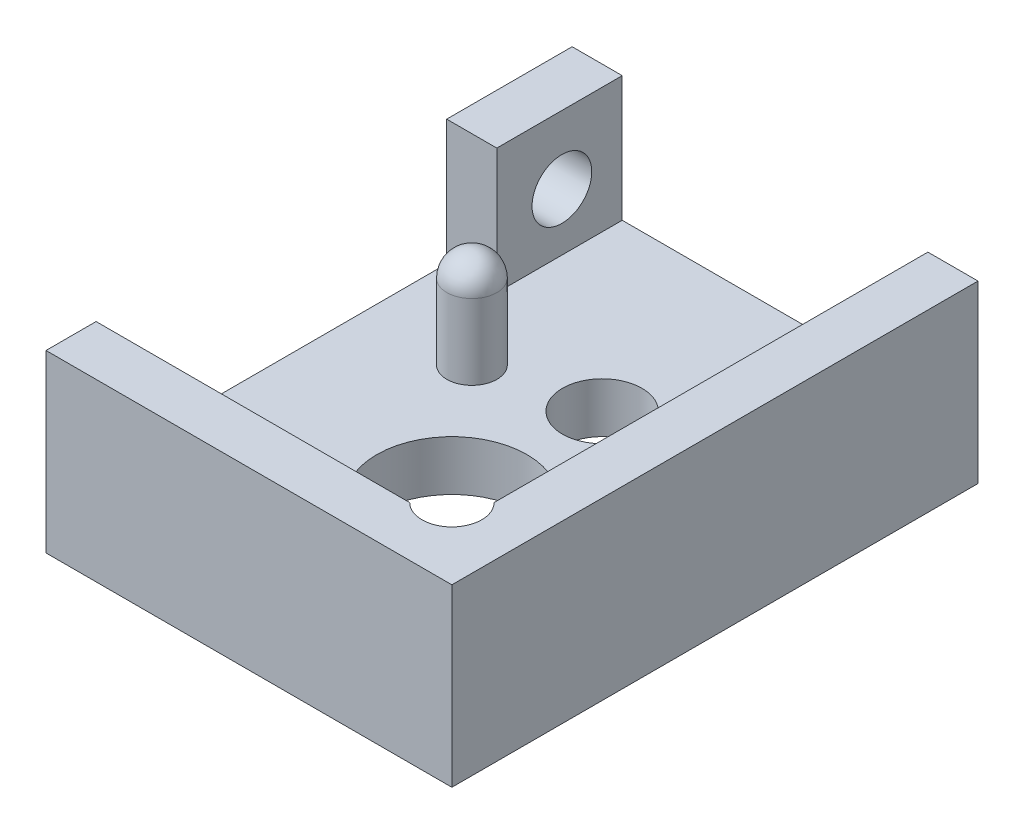
ISO-10303-21;
HEADER;
FILE_DESCRIPTION(('STEP AP214'),'2;1');
FILE_NAME('part.step','',(''),(''),'','','');
FILE_SCHEMA(('AUTOMOTIVE_DESIGN { 1 0 10303 214 1 1 1 1 }'));
ENDSEC;
DATA;
#1=APPLICATION_CONTEXT('core data for automotive mechanical design processes');
#2=APPLICATION_PROTOCOL_DEFINITION('international standard','automotive_design',2000,#1);
#3=PRODUCT_CONTEXT('',#1,'mechanical');
#4=PRODUCT('Part','Part','',(#3));
#5=PRODUCT_RELATED_PRODUCT_CATEGORY('part','',(#4));
#6=PRODUCT_DEFINITION_FORMATION('','',#4);
#7=PRODUCT_DEFINITION_CONTEXT('part definition',#1,'design');
#8=PRODUCT_DEFINITION('design','',#6,#7);
#9=PRODUCT_DEFINITION_SHAPE('','',#8);
#10=(LENGTH_UNIT() NAMED_UNIT(*) SI_UNIT(.MILLI.,.METRE.));
#11=(NAMED_UNIT(*) PLANE_ANGLE_UNIT() SI_UNIT($,.RADIAN.));
#12=(NAMED_UNIT(*) SI_UNIT($,.STERADIAN.) SOLID_ANGLE_UNIT());
#13=UNCERTAINTY_MEASURE_WITH_UNIT(LENGTH_MEASURE(1.E-05),#10,'distance_accuracy_value','');
#14=(GEOMETRIC_REPRESENTATION_CONTEXT(3) GLOBAL_UNCERTAINTY_ASSIGNED_CONTEXT((#13)) GLOBAL_UNIT_ASSIGNED_CONTEXT((#10,
#11,#12)) REPRESENTATION_CONTEXT('',''));
#15=CARTESIAN_POINT('',(0.,0.,0.));
#16=DIRECTION('',(0.,0.,1.));
#17=DIRECTION('',(1.,0.,0.));
#18=AXIS2_PLACEMENT_3D('',#15,#16,#17);
#19=CARTESIAN_POINT('',(-4.05,3.5,-5.75));
#20=DIRECTION('',(1.,0.,0.));
#21=DIRECTION('',(0.,0.,-1.));
#22=AXIS2_PLACEMENT_3D('',#19,#20,#21);
#23=PLANE('',#22);
#24=CARTESIAN_POINT('',(-4.05,2.14366257524023,-3.54575426754611));
#25=DIRECTION('',(-1.,0.,0.));
#26=DIRECTION('',(0.,0.,1.));
#27=AXIS2_PLACEMENT_3D('',#24,#25,#26);
#28=CIRCLE('',#27,0.595629999999989);
#29=CARTESIAN_POINT('',(-4.05,2.14366257524023,-2.95012426754612));
#30=VERTEX_POINT('',#29);
#31=EDGE_CURVE('E262',#30,#30,#28,.T.);
#32=ORIENTED_EDGE('',*,*,#31,.F.);
#33=EDGE_LOOP('',(#32));
#34=FACE_BOUND('',#33,.T.);
#35=DIRECTION('',(0.,-1.,0.));
#36=VECTOR('',#35,1.);
#37=CARTESIAN_POINT('',(-4.05,4.,-2.24649786886744));
#38=LINE('',#37,#36);
#39=CARTESIAN_POINT('',(-4.05,3.5,-2.24649786886744));
#40=VERTEX_POINT('',#39);
#41=CARTESIAN_POINT('',(-4.05,1.,-2.24649786886744));
#42=VERTEX_POINT('',#41);
#43=EDGE_CURVE('E124',#40,#42,#38,.T.);
#44=ORIENTED_EDGE('',*,*,#43,.F.);
#45=DIRECTION('',(0.,0.,1.));
#46=VECTOR('',#45,1.);
#47=CARTESIAN_POINT('',(-4.05,3.5,-5.75));
#48=LINE('',#47,#46);
#49=CARTESIAN_POINT('',(-4.05,3.5,-4.75));
#50=VERTEX_POINT('',#49);
#51=EDGE_CURVE('E161',#50,#40,#48,.T.);
#52=ORIENTED_EDGE('',*,*,#51,.F.);
#53=DIRECTION('',(0.,-1.,0.));
#54=VECTOR('',#53,1.);
#55=CARTESIAN_POINT('',(-4.05,3.5,-4.75));
#56=LINE('',#55,#54);
#57=CARTESIAN_POINT('',(-4.05,0.,-4.75));
#58=VERTEX_POINT('',#57);
#59=EDGE_CURVE('E249',#50,#58,#56,.T.);
#60=ORIENTED_EDGE('',*,*,#59,.T.);
#61=DIRECTION('',(0.,0.,1.));
#62=VECTOR('',#61,1.);
#63=CARTESIAN_POINT('',(-4.05,0.,-5.75));
#64=LINE('',#63,#62);
#65=CARTESIAN_POINT('',(-4.05,0.,5.75));
#66=VERTEX_POINT('',#65);
#67=EDGE_CURVE('E146',#58,#66,#64,.T.);
#68=ORIENTED_EDGE('',*,*,#67,.T.);
#69=DIRECTION('',(0.,-1.,0.));
#70=VECTOR('',#69,1.);
#71=CARTESIAN_POINT('',(-4.05,3.5,5.75));
#72=LINE('',#71,#70);
#73=CARTESIAN_POINT('',(-4.05,3.5,5.75));
#74=VERTEX_POINT('',#73);
#75=EDGE_CURVE('E177',#74,#66,#72,.T.);
#76=ORIENTED_EDGE('',*,*,#75,.F.);
#77=CARTESIAN_POINT('',(-4.05,3.5,4.75));
#78=VERTEX_POINT('',#77);
#79=EDGE_CURVE('E165',#78,#74,#48,.T.);
#80=ORIENTED_EDGE('',*,*,#79,.F.);
#81=DIRECTION('',(0.,-1.,0.));
#82=VECTOR('',#81,1.);
#83=CARTESIAN_POINT('',(-4.05,4.,4.75));
#84=LINE('',#83,#82);
#85=CARTESIAN_POINT('',(-4.05,1.,4.75));
#86=VERTEX_POINT('',#85);
#87=EDGE_CURVE('E223',#78,#86,#84,.T.);
#88=ORIENTED_EDGE('',*,*,#87,.T.);
#89=DIRECTION('',(0.,0.,1.));
#90=VECTOR('',#89,1.);
#91=CARTESIAN_POINT('',(-4.05,1.,4.75));
#92=LINE('',#91,#90);
#93=EDGE_CURVE('E129',#42,#86,#92,.T.);
#94=ORIENTED_EDGE('',*,*,#93,.F.);
#95=EDGE_LOOP('',(#44,#52,#60,#68,#76,#80,#88,#94));
#96=FACE_BOUND('',#95,.T.);
#97=ADVANCED_FACE('F35',(#34,#96),#23,.F.);
#98=CARTESIAN_POINT('',(0.,3.5,0.));
#99=DIRECTION('',(0.,-1.,0.));
#100=DIRECTION('',(0.,0.,-1.));
#101=AXIS2_PLACEMENT_3D('',#98,#99,#100);
#102=PLANE('',#101);
#103=DIRECTION('',(-1.,0.,0.));
#104=VECTOR('',#103,1.);
#105=CARTESIAN_POINT('',(0.,3.5,-2.24649786886744));
#106=LINE('',#105,#104);
#107=CARTESIAN_POINT('',(-3.05,3.5,-2.24649786886744));
#108=VERTEX_POINT('',#107);
#109=EDGE_CURVE('E255',#108,#40,#106,.T.);
#110=ORIENTED_EDGE('',*,*,#109,.F.);
#111=DIRECTION('',(0.,0.,1.));
#112=VECTOR('',#111,1.);
#113=CARTESIAN_POINT('',(-3.05,3.5,-4.75));
#114=LINE('',#113,#112);
#115=CARTESIAN_POINT('',(-3.05,3.5,-4.75));
#116=VERTEX_POINT('',#115);
#117=EDGE_CURVE('E139',#116,#108,#114,.T.);
#118=ORIENTED_EDGE('',*,*,#117,.F.);
#119=DIRECTION('',(-1.,0.,0.));
#120=VECTOR('',#119,1.);
#121=CARTESIAN_POINT('',(0.,3.5,-4.75));
#122=LINE('',#121,#120);
#123=EDGE_CURVE('E58',#116,#50,#122,.T.);
#124=ORIENTED_EDGE('',*,*,#123,.T.);
#125=ORIENTED_EDGE('',*,*,#51,.T.);
#126=EDGE_LOOP('',(#110,#118,#124,#125));
#127=FACE_BOUND('',#126,.T.);
#128=ADVANCED_FACE('F270',(#127),#102,.F.);
#129=DIRECTION('',(1.,0.,0.));
#130=VECTOR('',#129,1.);
#131=CARTESIAN_POINT('',(3.05,3.5,4.75));
#132=LINE('',#131,#130);
#133=CARTESIAN_POINT('',(2.20810098864976,3.5,4.75));
#134=VERTEX_POINT('',#133);
#135=EDGE_CURVE('E218',#78,#134,#132,.T.);
#136=ORIENTED_EDGE('',*,*,#135,.F.);
#137=ORIENTED_EDGE('',*,*,#79,.T.);
#138=DIRECTION('',(1.,0.,0.));
#139=VECTOR('',#138,1.);
#140=CARTESIAN_POINT('',(4.05,3.5,5.75));
#141=LINE('',#140,#139);
#142=CARTESIAN_POINT('',(4.05,3.5,5.75));
#143=VERTEX_POINT('',#142);
#144=EDGE_CURVE('E164',#74,#143,#141,.T.);
#145=ORIENTED_EDGE('',*,*,#144,.T.);
#146=DIRECTION('',(0.,0.,-1.));
#147=VECTOR('',#146,1.);
#148=CARTESIAN_POINT('',(4.05,3.5,-5.75));
#149=LINE('',#148,#147);
#150=CARTESIAN_POINT('',(4.05,3.5,-4.75));
#151=VERTEX_POINT('',#150);
#152=EDGE_CURVE('E167',#143,#151,#149,.T.);
#153=ORIENTED_EDGE('',*,*,#152,.T.);
#154=CARTESIAN_POINT('',(3.05,3.5,-4.75));
#155=VERTEX_POINT('',#154);
#156=EDGE_CURVE('E248',#151,#155,#122,.T.);
#157=ORIENTED_EDGE('',*,*,#156,.T.);
#158=DIRECTION('',(0.,0.,-1.));
#159=VECTOR('',#158,1.);
#160=CARTESIAN_POINT('',(3.05,3.5,-4.75));
#161=LINE('',#160,#159);
#162=CARTESIAN_POINT('',(3.05,3.5,3.90810098864976));
#163=VERTEX_POINT('',#162);
#164=EDGE_CURVE('E215',#163,#155,#161,.T.);
#165=ORIENTED_EDGE('',*,*,#164,.F.);
#166=CARTESIAN_POINT('',(2.62905049432488,3.5,4.32905049432488));
#167=DIRECTION('',(0.,1.,0.));
#168=DIRECTION('',(0.,0.,1.));
#169=AXIS2_PLACEMENT_3D('',#166,#167,#168);
#170=CIRCLE('',#169,0.595312500000001);
#171=EDGE_CURVE('E50',#134,#163,#170,.T.);
#172=ORIENTED_EDGE('',*,*,#171,.F.);
#173=EDGE_LOOP('',(#136,#137,#145,#153,#157,#165,#172));
#174=FACE_BOUND('',#173,.T.);
#175=ADVANCED_FACE('F226',(#174),#102,.F.);
#176=CARTESIAN_POINT('',(-3.05,-11.2898184219234,-4.75));
#177=DIRECTION('',(-1.,0.,0.));
#178=DIRECTION('',(0.,0.,1.));
#179=AXIS2_PLACEMENT_3D('',#176,#177,#178);
#180=PLANE('',#179);
#181=CARTESIAN_POINT('',(-3.05,2.14366257524023,-3.54575426754611));
#182=DIRECTION('',(-1.,0.,0.));
#183=DIRECTION('',(0.,0.,1.));
#184=AXIS2_PLACEMENT_3D('',#181,#182,#183);
#185=CIRCLE('',#184,0.595629999999989);
#186=CARTESIAN_POINT('',(-3.05,2.14366257524023,-2.95012426754612));
#187=VERTEX_POINT('',#186);
#188=EDGE_CURVE('E130',#187,#187,#185,.T.);
#189=ORIENTED_EDGE('',*,*,#188,.T.);
#190=EDGE_LOOP('',(#189));
#191=FACE_BOUND('',#190,.T.);
#192=DIRECTION('',(0.,1.,0.));
#193=VECTOR('',#192,1.);
#194=CARTESIAN_POINT('',(-3.05,-11.2898184219234,-2.24649786886744));
#195=LINE('',#194,#193);
#196=CARTESIAN_POINT('',(-3.05,1.,-2.24649786886744));
#197=VERTEX_POINT('',#196);
#198=EDGE_CURVE('E121',#197,#108,#195,.T.);
#199=ORIENTED_EDGE('',*,*,#198,.F.);
#200=DIRECTION('',(0.,0.,1.));
#201=VECTOR('',#200,1.);
#202=CARTESIAN_POINT('',(-3.05,1.,-4.75));
#203=LINE('',#202,#201);
#204=CARTESIAN_POINT('',(-3.05,1.,-4.75));
#205=VERTEX_POINT('',#204);
#206=EDGE_CURVE('E136',#205,#197,#203,.T.);
#207=ORIENTED_EDGE('',*,*,#206,.F.);
#208=DIRECTION('',(0.,1.,0.));
#209=VECTOR('',#208,1.);
#210=CARTESIAN_POINT('',(-3.05,-11.2898184219234,-4.75));
#211=LINE('',#210,#209);
#212=EDGE_CURVE('E147',#205,#116,#211,.T.);
#213=ORIENTED_EDGE('',*,*,#212,.T.);
#214=ORIENTED_EDGE('',*,*,#117,.T.);
#215=EDGE_LOOP('',(#199,#207,#213,#214));
#216=FACE_BOUND('',#215,.T.);
#217=ADVANCED_FACE('F135',(#191,#216),#180,.F.);
#218=CARTESIAN_POINT('',(4.05,3.5,5.75));
#219=DIRECTION('',(0.,0.,-1.));
#220=DIRECTION('',(-1.,0.,0.));
#221=AXIS2_PLACEMENT_3D('',#218,#219,#220);
#222=PLANE('',#221);
#223=DIRECTION('',(1.,0.,0.));
#224=VECTOR('',#223,1.);
#225=CARTESIAN_POINT('',(4.05,0.,5.75));
#226=LINE('',#225,#224);
#227=CARTESIAN_POINT('',(4.05,0.,5.75));
#228=VERTEX_POINT('',#227);
#229=EDGE_CURVE('E149',#66,#228,#226,.T.);
#230=ORIENTED_EDGE('',*,*,#229,.T.);
#231=DIRECTION('',(0.,-1.,0.));
#232=VECTOR('',#231,1.);
#233=CARTESIAN_POINT('',(4.05,3.5,5.75));
#234=LINE('',#233,#232);
#235=EDGE_CURVE('E169',#143,#228,#234,.T.);
#236=ORIENTED_EDGE('',*,*,#235,.F.);
#237=ORIENTED_EDGE('',*,*,#144,.F.);
#238=ORIENTED_EDGE('',*,*,#75,.T.);
#239=EDGE_LOOP('',(#230,#236,#237,#238));
#240=FACE_BOUND('',#239,.T.);
#241=ADVANCED_FACE('F286',(#240),#222,.F.);
#242=CARTESIAN_POINT('',(4.05,3.5,-5.75));
#243=DIRECTION('',(-1.,0.,0.));
#244=DIRECTION('',(0.,0.,1.));
#245=AXIS2_PLACEMENT_3D('',#242,#243,#244);
#246=PLANE('',#245);
#247=DIRECTION('',(0.,0.,-1.));
#248=VECTOR('',#247,1.);
#249=CARTESIAN_POINT('',(4.05,0.,-5.75));
#250=LINE('',#249,#248);
#251=CARTESIAN_POINT('',(4.05,0.,-4.75));
#252=VERTEX_POINT('',#251);
#253=EDGE_CURVE('E172',#228,#252,#250,.T.);
#254=ORIENTED_EDGE('',*,*,#253,.T.);
#255=DIRECTION('',(0.,1.,0.));
#256=VECTOR('',#255,1.);
#257=CARTESIAN_POINT('',(4.05,3.5,-4.75));
#258=LINE('',#257,#256);
#259=EDGE_CURVE('E243',#252,#151,#258,.T.);
#260=ORIENTED_EDGE('',*,*,#259,.T.);
#261=ORIENTED_EDGE('',*,*,#152,.F.);
#262=ORIENTED_EDGE('',*,*,#235,.T.);
#263=EDGE_LOOP('',(#254,#260,#261,#262));
#264=FACE_BOUND('',#263,.T.);
#265=ADVANCED_FACE('F282',(#264),#246,.F.);
#266=CARTESIAN_POINT('',(0.,0.,0.));
#267=DIRECTION('',(0.,-1.,0.));
#268=DIRECTION('',(0.,0.,-1.));
#269=AXIS2_PLACEMENT_3D('',#266,#267,#268);
#270=PLANE('',#269);
#271=DIRECTION('',(-1.,0.,0.));
#272=VECTOR('',#271,1.);
#273=CARTESIAN_POINT('',(4.26138971579345,0.,-4.75));
#274=LINE('',#273,#272);
#275=EDGE_CURVE('E253',#252,#58,#274,.T.);
#276=ORIENTED_EDGE('',*,*,#275,.F.);
#277=ORIENTED_EDGE('',*,*,#253,.F.);
#278=ORIENTED_EDGE('',*,*,#229,.F.);
#279=ORIENTED_EDGE('',*,*,#67,.F.);
#280=EDGE_LOOP('',(#276,#277,#278,#279));
#281=FACE_BOUND('',#280,.T.);
#282=CARTESIAN_POINT('',(1.925,0.,3.5));
#283=DIRECTION('',(0.,1.,0.));
#284=DIRECTION('',(0.,0.,1.));
#285=AXIS2_PLACEMENT_3D('',#282,#283,#284);
#286=CIRCLE('',#285,0.793750000000001);
#287=CARTESIAN_POINT('',(1.925,0.,4.29375));
#288=VERTEX_POINT('',#287);
#289=EDGE_CURVE('E239',#288,#288,#286,.T.);
#290=ORIENTED_EDGE('',*,*,#289,.T.);
#291=EDGE_LOOP('',(#290));
#292=FACE_BOUND('',#291,.T.);
#293=CARTESIAN_POINT('',(-1.825,0.,3.5));
#294=DIRECTION('',(0.,1.,0.));
#295=DIRECTION('',(0.,0.,1.));
#296=AXIS2_PLACEMENT_3D('',#293,#294,#295);
#297=CIRCLE('',#296,0.793750000000001);
#298=CARTESIAN_POINT('',(-1.825,0.,4.29375));
#299=VERTEX_POINT('',#298);
#300=EDGE_CURVE('E236',#299,#299,#297,.T.);
#301=ORIENTED_EDGE('',*,*,#300,.T.);
#302=EDGE_LOOP('',(#301));
#303=FACE_BOUND('',#302,.T.);
#304=CARTESIAN_POINT('',(0.0499999999999988,0.,-1.25));
#305=DIRECTION('',(0.,1.,0.));
#306=DIRECTION('',(0.,0.,1.));
#307=AXIS2_PLACEMENT_3D('',#304,#305,#306);
#308=CIRCLE('',#307,0.79375);
#309=CARTESIAN_POINT('',(0.0499999999999988,0.,-0.456250000000002));
#310=VERTEX_POINT('',#309);
#311=EDGE_CURVE('E230',#310,#310,#308,.T.);
#312=ORIENTED_EDGE('',*,*,#311,.T.);
#313=EDGE_LOOP('',(#312));
#314=FACE_BOUND('',#313,.T.);
#315=CARTESIAN_POINT('',(0.0499999999999993,0.,1.75));
#316=DIRECTION('',(0.,1.,0.));
#317=DIRECTION('',(0.,0.,1.));
#318=AXIS2_PLACEMENT_3D('',#315,#316,#317);
#319=CIRCLE('',#318,1.5);
#320=CARTESIAN_POINT('',(0.0499999999999993,0.,3.25));
#321=VERTEX_POINT('',#320);
#322=EDGE_CURVE('E206',#321,#321,#319,.T.);
#323=ORIENTED_EDGE('',*,*,#322,.T.);
#324=EDGE_LOOP('',(#323));
#325=FACE_BOUND('',#324,.T.);
#326=ADVANCED_FACE('F188',(#281,#292,#303,#314,#325),#270,.T.);
#327=CARTESIAN_POINT('',(0.,1.,0.));
#328=DIRECTION('',(0.,-1.,0.));
#329=DIRECTION('',(0.,0.,-1.));
#330=AXIS2_PLACEMENT_3D('',#327,#328,#329);
#331=PLANE('',#330);
#332=CARTESIAN_POINT('',(-2.05,1.,-0.750000000000002));
#333=DIRECTION('',(0.,-1.,0.));
#334=DIRECTION('',(0.,0.,-1.));
#335=AXIS2_PLACEMENT_3D('',#332,#333,#334);
#336=CIRCLE('',#335,0.5);
#337=CARTESIAN_POINT('',(-2.05,1.,-1.25));
#338=VERTEX_POINT('',#337);
#339=EDGE_CURVE('E43',#338,#338,#336,.F.);
#340=ORIENTED_EDGE('',*,*,#339,.F.);
#341=EDGE_LOOP('',(#340));
#342=FACE_BOUND('',#341,.T.);
#343=CARTESIAN_POINT('',(1.925,1.,3.5));
#344=DIRECTION('',(0.,1.,0.));
#345=DIRECTION('',(0.,0.,1.));
#346=AXIS2_PLACEMENT_3D('',#343,#344,#345);
#347=CIRCLE('',#346,0.793750000000001);
#348=CARTESIAN_POINT('',(1.925,1.,4.29375));
#349=VERTEX_POINT('',#348);
#350=EDGE_CURVE('E193',#349,#349,#347,.T.);
#351=ORIENTED_EDGE('',*,*,#350,.F.);
#352=EDGE_LOOP('',(#351));
#353=FACE_BOUND('',#352,.T.);
#354=CARTESIAN_POINT('',(-1.825,1.,3.5));
#355=DIRECTION('',(0.,1.,0.));
#356=DIRECTION('',(0.,0.,1.));
#357=AXIS2_PLACEMENT_3D('',#354,#355,#356);
#358=CIRCLE('',#357,0.793750000000001);
#359=CARTESIAN_POINT('',(-1.825,1.,4.29375));
#360=VERTEX_POINT('',#359);
#361=EDGE_CURVE('E197',#360,#360,#358,.T.);
#362=ORIENTED_EDGE('',*,*,#361,.F.);
#363=EDGE_LOOP('',(#362));
#364=FACE_BOUND('',#363,.T.);
#365=CARTESIAN_POINT('',(0.0499999999999988,1.,-1.25));
#366=DIRECTION('',(0.,1.,0.));
#367=DIRECTION('',(0.,0.,1.));
#368=AXIS2_PLACEMENT_3D('',#365,#366,#367);
#369=CIRCLE('',#368,0.79375);
#370=CARTESIAN_POINT('',(0.0499999999999988,1.,-0.456250000000002));
#371=VERTEX_POINT('',#370);
#372=EDGE_CURVE('E201',#371,#371,#369,.T.);
#373=ORIENTED_EDGE('',*,*,#372,.F.);
#374=EDGE_LOOP('',(#373));
#375=FACE_BOUND('',#374,.T.);
#376=CARTESIAN_POINT('',(0.0499999999999993,1.,1.75));
#377=DIRECTION('',(0.,1.,0.));
#378=DIRECTION('',(0.,0.,1.));
#379=AXIS2_PLACEMENT_3D('',#376,#377,#378);
#380=CIRCLE('',#379,1.5);
#381=CARTESIAN_POINT('',(0.0499999999999993,1.,3.25));
#382=VERTEX_POINT('',#381);
#383=EDGE_CURVE('E204',#382,#382,#380,.T.);
#384=ORIENTED_EDGE('',*,*,#383,.F.);
#385=EDGE_LOOP('',(#384));
#386=FACE_BOUND('',#385,.T.);
#387=DIRECTION('',(1.,0.,0.));
#388=VECTOR('',#387,1.);
#389=CARTESIAN_POINT('',(3.05,1.,4.75));
#390=LINE('',#389,#388);
#391=CARTESIAN_POINT('',(2.20810098864976,1.,4.75));
#392=VERTEX_POINT('',#391);
#393=EDGE_CURVE('E154',#86,#392,#390,.T.);
#394=ORIENTED_EDGE('',*,*,#393,.T.);
#395=CARTESIAN_POINT('',(2.62905049432488,1.,4.32905049432488));
#396=DIRECTION('',(0.,-1.,0.));
#397=DIRECTION('',(0.,0.,-1.));
#398=AXIS2_PLACEMENT_3D('',#395,#396,#397);
#399=CIRCLE('',#398,0.595312500000001);
#400=CARTESIAN_POINT('',(3.05,1.,3.90810098864976));
#401=VERTEX_POINT('',#400);
#402=EDGE_CURVE('E212',#392,#401,#399,.F.);
#403=ORIENTED_EDGE('',*,*,#402,.T.);
#404=DIRECTION('',(0.,0.,-1.));
#405=VECTOR('',#404,1.);
#406=CARTESIAN_POINT('',(3.05,1.,-4.75));
#407=LINE('',#406,#405);
#408=CARTESIAN_POINT('',(3.05,1.,-4.75));
#409=VERTEX_POINT('',#408);
#410=EDGE_CURVE('E158',#401,#409,#407,.T.);
#411=ORIENTED_EDGE('',*,*,#410,.T.);
#412=DIRECTION('',(-1.,0.,0.));
#413=VECTOR('',#412,1.);
#414=CARTESIAN_POINT('',(3.05,1.,-4.75));
#415=LINE('',#414,#413);
#416=EDGE_CURVE('E145',#409,#205,#415,.T.);
#417=ORIENTED_EDGE('',*,*,#416,.T.);
#418=ORIENTED_EDGE('',*,*,#206,.T.);
#419=DIRECTION('',(-1.,0.,0.));
#420=VECTOR('',#419,1.);
#421=CARTESIAN_POINT('',(-3.05,1.,-2.24649786886744));
#422=LINE('',#421,#420);
#423=EDGE_CURVE('E118',#197,#42,#422,.T.);
#424=ORIENTED_EDGE('',*,*,#423,.T.);
#425=ORIENTED_EDGE('',*,*,#93,.T.);
#426=EDGE_LOOP('',(#394,#403,#411,#417,#418,#424,#425));
#427=FACE_BOUND('',#426,.T.);
#428=ADVANCED_FACE('F143',(#342,#353,#364,#375,#386,#427),#331,.F.);
#429=CARTESIAN_POINT('',(3.05,-11.2898184219234,4.75));
#430=DIRECTION('',(0.,0.,1.));
#431=DIRECTION('',(1.,0.,0.));
#432=AXIS2_PLACEMENT_3D('',#429,#430,#431);
#433=PLANE('',#432);
#434=ORIENTED_EDGE('',*,*,#135,.T.);
#435=DIRECTION('',(0.,1.,0.));
#436=VECTOR('',#435,1.);
#437=CARTESIAN_POINT('',(2.20810098864976,-0.68379802270047,4.75));
#438=LINE('',#437,#436);
#439=EDGE_CURVE('E207',#134,#392,#438,.F.);
#440=ORIENTED_EDGE('',*,*,#439,.T.);
#441=ORIENTED_EDGE('',*,*,#393,.F.);
#442=ORIENTED_EDGE('',*,*,#87,.F.);
#443=EDGE_LOOP('',(#434,#440,#441,#442));
#444=FACE_BOUND('',#443,.T.);
#445=ADVANCED_FACE('F187',(#444),#433,.F.);
#446=CARTESIAN_POINT('',(3.05,-11.2898184219234,-4.75));
#447=DIRECTION('',(1.,0.,0.));
#448=DIRECTION('',(0.,0.,-1.));
#449=AXIS2_PLACEMENT_3D('',#446,#447,#448);
#450=PLANE('',#449);
#451=ORIENTED_EDGE('',*,*,#410,.F.);
#452=DIRECTION('',(0.,1.,0.));
#453=VECTOR('',#452,1.);
#454=CARTESIAN_POINT('',(3.05,-0.68379802270047,3.90810098864976));
#455=LINE('',#454,#453);
#456=EDGE_CURVE('E140',#401,#163,#455,.T.);
#457=ORIENTED_EDGE('',*,*,#456,.T.);
#458=ORIENTED_EDGE('',*,*,#164,.T.);
#459=DIRECTION('',(0.,1.,0.));
#460=VECTOR('',#459,1.);
#461=CARTESIAN_POINT('',(3.05,-11.2898184219234,-4.75));
#462=LINE('',#461,#460);
#463=EDGE_CURVE('E157',#409,#155,#462,.T.);
#464=ORIENTED_EDGE('',*,*,#463,.F.);
#465=EDGE_LOOP('',(#451,#457,#458,#464));
#466=FACE_BOUND('',#465,.T.);
#467=ADVANCED_FACE('F307',(#466),#450,.F.);
#468=CARTESIAN_POINT('',(0.0499999999999993,0.,1.75));
#469=DIRECTION('',(0.,1.,0.));
#470=DIRECTION('',(0.,0.,1.));
#471=AXIS2_PLACEMENT_3D('',#468,#469,#470);
#472=CYLINDRICAL_SURFACE('',#471,1.5);
#473=ORIENTED_EDGE('',*,*,#322,.F.);
#474=EDGE_LOOP('',(#473));
#475=FACE_BOUND('',#474,.T.);
#476=ORIENTED_EDGE('',*,*,#383,.T.);
#477=EDGE_LOOP('',(#476));
#478=FACE_BOUND('',#477,.T.);
#479=ADVANCED_FACE('F311',(#475,#478),#472,.F.);
#480=CARTESIAN_POINT('',(2.62905049432488,-0.68379802270047,4.32905049432488));
#481=DIRECTION('',(0.,1.,0.));
#482=DIRECTION('',(0.,0.,1.));
#483=AXIS2_PLACEMENT_3D('',#480,#481,#482);
#484=CYLINDRICAL_SURFACE('',#483,0.595312500000001);
#485=ORIENTED_EDGE('',*,*,#171,.T.);
#486=ORIENTED_EDGE('',*,*,#456,.F.);
#487=ORIENTED_EDGE('',*,*,#402,.F.);
#488=ORIENTED_EDGE('',*,*,#439,.F.);
#489=EDGE_LOOP('',(#485,#486,#487,#488));
#490=FACE_BOUND('',#489,.T.);
#491=ADVANCED_FACE('F308',(#490),#484,.F.);
#492=CARTESIAN_POINT('',(0.0499999999999988,0.,-1.25));
#493=DIRECTION('',(0.,1.,0.));
#494=DIRECTION('',(0.,0.,1.));
#495=AXIS2_PLACEMENT_3D('',#492,#493,#494);
#496=CYLINDRICAL_SURFACE('',#495,0.79375);
#497=ORIENTED_EDGE('',*,*,#311,.F.);
#498=EDGE_LOOP('',(#497));
#499=FACE_BOUND('',#498,.T.);
#500=ORIENTED_EDGE('',*,*,#372,.T.);
#501=EDGE_LOOP('',(#500));
#502=FACE_BOUND('',#501,.T.);
#503=ADVANCED_FACE('F310',(#499,#502),#496,.F.);
#504=CARTESIAN_POINT('',(-1.825,0.,3.5));
#505=DIRECTION('',(0.,1.,0.));
#506=DIRECTION('',(0.,0.,1.));
#507=AXIS2_PLACEMENT_3D('',#504,#505,#506);
#508=CYLINDRICAL_SURFACE('',#507,0.793750000000001);
#509=ORIENTED_EDGE('',*,*,#300,.F.);
#510=EDGE_LOOP('',(#509));
#511=FACE_BOUND('',#510,.T.);
#512=ORIENTED_EDGE('',*,*,#361,.T.);
#513=EDGE_LOOP('',(#512));
#514=FACE_BOUND('',#513,.T.);
#515=ADVANCED_FACE('F317',(#511,#514),#508,.F.);
#516=CARTESIAN_POINT('',(1.925,0.,3.5));
#517=DIRECTION('',(0.,1.,0.));
#518=DIRECTION('',(0.,0.,1.));
#519=AXIS2_PLACEMENT_3D('',#516,#517,#518);
#520=CYLINDRICAL_SURFACE('',#519,0.793750000000001);
#521=ORIENTED_EDGE('',*,*,#289,.F.);
#522=EDGE_LOOP('',(#521));
#523=FACE_BOUND('',#522,.T.);
#524=ORIENTED_EDGE('',*,*,#350,.T.);
#525=EDGE_LOOP('',(#524));
#526=FACE_BOUND('',#525,.T.);
#527=ADVANCED_FACE('F364',(#523,#526),#520,.F.);
#528=CARTESIAN_POINT('',(4.26138971579345,4.,-4.75));
#529=DIRECTION('',(0.,0.,1.));
#530=DIRECTION('',(1.,0.,0.));
#531=AXIS2_PLACEMENT_3D('',#528,#529,#530);
#532=PLANE('',#531);
#533=ORIENTED_EDGE('',*,*,#275,.T.);
#534=ORIENTED_EDGE('',*,*,#59,.F.);
#535=ORIENTED_EDGE('',*,*,#123,.F.);
#536=ORIENTED_EDGE('',*,*,#212,.F.);
#537=ORIENTED_EDGE('',*,*,#416,.F.);
#538=ORIENTED_EDGE('',*,*,#463,.T.);
#539=ORIENTED_EDGE('',*,*,#156,.F.);
#540=ORIENTED_EDGE('',*,*,#259,.F.);
#541=EDGE_LOOP('',(#533,#534,#535,#536,#537,#538,#539,#540));
#542=FACE_BOUND('',#541,.T.);
#543=ADVANCED_FACE('F303',(#542),#532,.F.);
#544=CARTESIAN_POINT('',(-3.05,4.,-2.24649786886744));
#545=DIRECTION('',(0.,0.,1.));
#546=DIRECTION('',(1.,0.,0.));
#547=AXIS2_PLACEMENT_3D('',#544,#545,#546);
#548=PLANE('',#547);
#549=ORIENTED_EDGE('',*,*,#109,.T.);
#550=ORIENTED_EDGE('',*,*,#43,.T.);
#551=ORIENTED_EDGE('',*,*,#423,.F.);
#552=ORIENTED_EDGE('',*,*,#198,.T.);
#553=EDGE_LOOP('',(#549,#550,#551,#552));
#554=FACE_BOUND('',#553,.T.);
#555=ADVANCED_FACE('F120',(#554),#548,.T.);
#556=CARTESIAN_POINT('',(-2.05,3.,-0.750000000000002));
#557=DIRECTION('',(0.,-1.,0.));
#558=DIRECTION('',(0.,0.,-1.));
#559=AXIS2_PLACEMENT_3D('',#556,#557,#558);
#560=CYLINDRICAL_SURFACE('',#559,0.5);
#561=CARTESIAN_POINT('',(-2.05,2.5,-0.750000000000002));
#562=DIRECTION('',(0.,-1.,0.));
#563=DIRECTION('',(0.,0.,-1.));
#564=AXIS2_PLACEMENT_3D('',#561,#562,#563);
#565=CIRCLE('',#564,0.5);
#566=CARTESIAN_POINT('',(-2.05,2.5,-1.25));
#567=VERTEX_POINT('',#566);
#568=EDGE_CURVE('E12',#567,#567,#565,.T.);
#569=ORIENTED_EDGE('',*,*,#568,.T.);
#570=EDGE_LOOP('',(#569));
#571=FACE_BOUND('',#570,.T.);
#572=ORIENTED_EDGE('',*,*,#339,.T.);
#573=EDGE_LOOP('',(#572));
#574=FACE_BOUND('',#573,.T.);
#575=ADVANCED_FACE('F183',(#571,#574),#560,.T.);
#576=CARTESIAN_POINT('',(-2.05,2.5,-0.750000000000002));
#577=DIRECTION('',(0.,0.,1.));
#578=DIRECTION('',(1.,0.,0.));
#579=AXIS2_PLACEMENT_3D('',#576,#577,#578);
#580=SPHERICAL_SURFACE('',#579,0.5);
#581=CARTESIAN_POINT('',(-2.05,2.5,-0.750000000000002));
#582=DIRECTION('',(0.,-1.,0.));
#583=DIRECTION('',(0.,0.,-1.));
#584=AXIS2_PLACEMENT_3D('',#581,#582,#583);
#585=SPHERICAL_SURFACE('',#584,0.5);
#586=ORIENTED_EDGE('',*,*,#568,.F.);
#587=EDGE_LOOP('',(#586));
#588=FACE_BOUND('',#587,.T.);
#589=ADVANCED_FACE('F37',(#588),#585,.T.);
#590=CARTESIAN_POINT('',(-4.05,2.14366257524023,-3.54575426754611));
#591=DIRECTION('',(-1.,0.,0.));
#592=DIRECTION('',(0.,0.,1.));
#593=AXIS2_PLACEMENT_3D('',#590,#591,#592);
#594=CYLINDRICAL_SURFACE('',#593,0.595629999999989);
#595=ORIENTED_EDGE('',*,*,#188,.F.);
#596=EDGE_LOOP('',(#595));
#597=FACE_BOUND('',#596,.T.);
#598=ORIENTED_EDGE('',*,*,#31,.T.);
#599=EDGE_LOOP('',(#598));
#600=FACE_BOUND('',#599,.T.);
#601=ADVANCED_FACE('F266',(#597,#600),#594,.F.);
#602=CLOSED_SHELL('',(#97,#128,#175,#217,#241,#265,#326,#428,#445,#467,#479,#491,#503,#515,#527,
#543,#555,#575,#589,#601));
#603=MANIFOLD_SOLID_BREP('B2',#602);
#604=ADVANCED_BREP_SHAPE_REPRESENTATION('',(#18,#603),#14);
#605=SHAPE_DEFINITION_REPRESENTATION(#9,#604);
ENDSEC;
END-ISO-10303-21;
